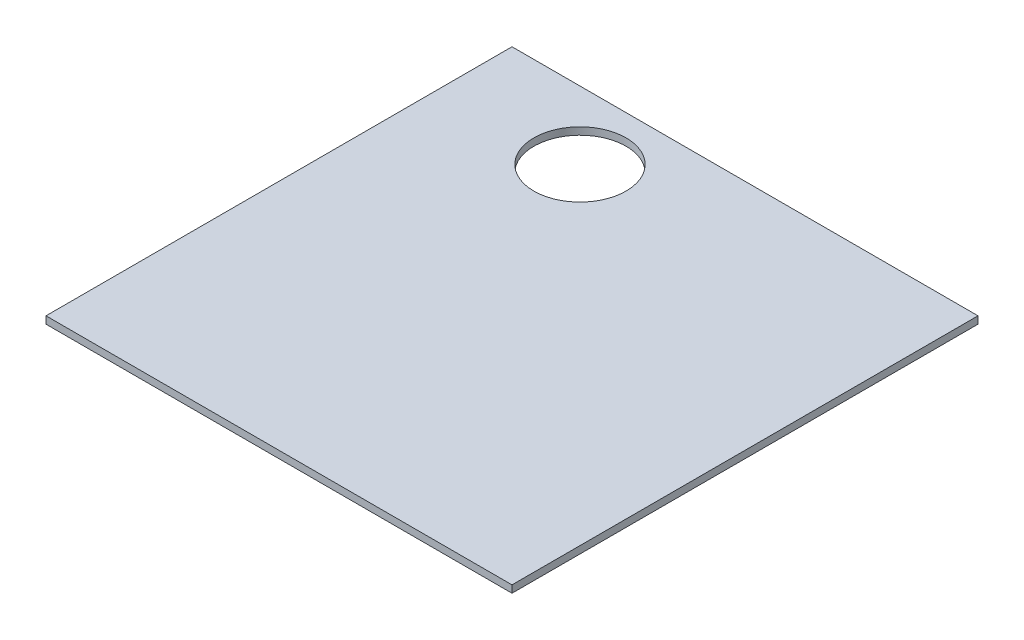
ISO-10303-21;
HEADER;
FILE_DESCRIPTION(('STEP AP214'),'2;1');
FILE_NAME('part.step','',(''),(''),'','','');
FILE_SCHEMA(('AUTOMOTIVE_DESIGN { 1 0 10303 214 1 1 1 1 }'));
ENDSEC;
DATA;
#1=APPLICATION_CONTEXT('core data for automotive mechanical design processes');
#2=APPLICATION_PROTOCOL_DEFINITION('international standard','automotive_design',2000,#1);
#3=PRODUCT_CONTEXT('',#1,'mechanical');
#4=PRODUCT('Part','Part','',(#3));
#5=PRODUCT_RELATED_PRODUCT_CATEGORY('part','',(#4));
#6=PRODUCT_DEFINITION_FORMATION('','',#4);
#7=PRODUCT_DEFINITION_CONTEXT('part definition',#1,'design');
#8=PRODUCT_DEFINITION('design','',#6,#7);
#9=PRODUCT_DEFINITION_SHAPE('','',#8);
#10=(LENGTH_UNIT() NAMED_UNIT(*) SI_UNIT(.MILLI.,.METRE.));
#11=(NAMED_UNIT(*) PLANE_ANGLE_UNIT() SI_UNIT($,.RADIAN.));
#12=(NAMED_UNIT(*) SI_UNIT($,.STERADIAN.) SOLID_ANGLE_UNIT());
#13=UNCERTAINTY_MEASURE_WITH_UNIT(LENGTH_MEASURE(1.E-05),#10,'distance_accuracy_value','');
#14=(GEOMETRIC_REPRESENTATION_CONTEXT(3) GLOBAL_UNCERTAINTY_ASSIGNED_CONTEXT((#13)) GLOBAL_UNIT_ASSIGNED_CONTEXT((#10,
#11,#12)) REPRESENTATION_CONTEXT('',''));
#15=CARTESIAN_POINT('',(0.,0.,0.));
#16=DIRECTION('',(0.,0.,1.));
#17=DIRECTION('',(1.,0.,0.));
#18=AXIS2_PLACEMENT_3D('',#15,#16,#17);
#19=CARTESIAN_POINT('',(0.,4.7625,0.));
#20=DIRECTION('',(1.,0.,0.));
#21=DIRECTION('',(0.,0.,-1.));
#22=AXIS2_PLACEMENT_3D('',#19,#20,#21);
#23=PLANE('',#22);
#24=DIRECTION('',(0.,0.,1.));
#25=VECTOR('',#24,1.);
#26=CARTESIAN_POINT('',(0.,0.,0.));
#27=LINE('',#26,#25);
#28=CARTESIAN_POINT('',(0.,0.,-304.8));
#29=VERTEX_POINT('',#28);
#30=CARTESIAN_POINT('',(0.,0.,0.));
#31=VERTEX_POINT('',#30);
#32=EDGE_CURVE('E107',#29,#31,#27,.T.);
#33=ORIENTED_EDGE('',*,*,#32,.T.);
#34=DIRECTION('',(0.,-1.,0.));
#35=VECTOR('',#34,1.);
#36=CARTESIAN_POINT('',(0.,4.7625,0.));
#37=LINE('',#36,#35);
#38=CARTESIAN_POINT('',(0.,4.7625,0.));
#39=VERTEX_POINT('',#38);
#40=EDGE_CURVE('E11',#39,#31,#37,.T.);
#41=ORIENTED_EDGE('',*,*,#40,.F.);
#42=DIRECTION('',(0.,0.,1.));
#43=VECTOR('',#42,1.);
#44=CARTESIAN_POINT('',(0.,4.7625,0.));
#45=LINE('',#44,#43);
#46=CARTESIAN_POINT('',(0.,4.7625,-304.8));
#47=VERTEX_POINT('',#46);
#48=EDGE_CURVE('E91',#47,#39,#45,.T.);
#49=ORIENTED_EDGE('',*,*,#48,.F.);
#50=DIRECTION('',(0.,-1.,0.));
#51=VECTOR('',#50,1.);
#52=CARTESIAN_POINT('',(0.,4.7625,-304.8));
#53=LINE('',#52,#51);
#54=EDGE_CURVE('E103',#47,#29,#53,.T.);
#55=ORIENTED_EDGE('',*,*,#54,.T.);
#56=EDGE_LOOP('',(#33,#41,#49,#55));
#57=FACE_BOUND('',#56,.T.);
#58=ADVANCED_FACE('F39',(#57),#23,.F.);
#59=CARTESIAN_POINT('',(0.,4.7625,0.));
#60=DIRECTION('',(0.,0.,-1.));
#61=DIRECTION('',(-1.,0.,0.));
#62=AXIS2_PLACEMENT_3D('',#59,#60,#61);
#63=PLANE('',#62);
#64=DIRECTION('',(1.,0.,0.));
#65=VECTOR('',#64,1.);
#66=CARTESIAN_POINT('',(0.,0.,0.));
#67=LINE('',#66,#65);
#68=CARTESIAN_POINT('',(304.8,0.,0.));
#69=VERTEX_POINT('',#68);
#70=EDGE_CURVE('E96',#31,#69,#67,.T.);
#71=ORIENTED_EDGE('',*,*,#70,.T.);
#72=DIRECTION('',(0.,-1.,0.));
#73=VECTOR('',#72,1.);
#74=CARTESIAN_POINT('',(304.8,4.7625,0.));
#75=LINE('',#74,#73);
#76=CARTESIAN_POINT('',(304.8,4.7625,0.));
#77=VERTEX_POINT('',#76);
#78=EDGE_CURVE('E48',#77,#69,#75,.T.);
#79=ORIENTED_EDGE('',*,*,#78,.F.);
#80=DIRECTION('',(1.,0.,0.));
#81=VECTOR('',#80,1.);
#82=CARTESIAN_POINT('',(0.,4.7625,0.));
#83=LINE('',#82,#81);
#84=EDGE_CURVE('E86',#39,#77,#83,.T.);
#85=ORIENTED_EDGE('',*,*,#84,.F.);
#86=ORIENTED_EDGE('',*,*,#40,.T.);
#87=EDGE_LOOP('',(#71,#79,#85,#86));
#88=FACE_BOUND('',#87,.T.);
#89=ADVANCED_FACE('F95',(#88),#63,.F.);
#90=CARTESIAN_POINT('',(304.8,4.7625,0.));
#91=DIRECTION('',(-1.,0.,0.));
#92=DIRECTION('',(0.,0.,1.));
#93=AXIS2_PLACEMENT_3D('',#90,#91,#92);
#94=PLANE('',#93);
#95=DIRECTION('',(0.,0.,-1.));
#96=VECTOR('',#95,1.);
#97=CARTESIAN_POINT('',(304.8,0.,0.));
#98=LINE('',#97,#96);
#99=CARTESIAN_POINT('',(304.8,0.,-304.8));
#100=VERTEX_POINT('',#99);
#101=EDGE_CURVE('E73',#69,#100,#98,.T.);
#102=ORIENTED_EDGE('',*,*,#101,.T.);
#103=DIRECTION('',(0.,-1.,0.));
#104=VECTOR('',#103,1.);
#105=CARTESIAN_POINT('',(304.8,4.7625,-304.8));
#106=LINE('',#105,#104);
#107=CARTESIAN_POINT('',(304.8,4.7625,-304.8));
#108=VERTEX_POINT('',#107);
#109=EDGE_CURVE('E98',#108,#100,#106,.T.);
#110=ORIENTED_EDGE('',*,*,#109,.F.);
#111=DIRECTION('',(0.,0.,-1.));
#112=VECTOR('',#111,1.);
#113=CARTESIAN_POINT('',(304.8,4.7625,0.));
#114=LINE('',#113,#112);
#115=EDGE_CURVE('E89',#77,#108,#114,.T.);
#116=ORIENTED_EDGE('',*,*,#115,.F.);
#117=ORIENTED_EDGE('',*,*,#78,.T.);
#118=EDGE_LOOP('',(#102,#110,#116,#117));
#119=FACE_BOUND('',#118,.T.);
#120=ADVANCED_FACE('F99',(#119),#94,.F.);
#121=CARTESIAN_POINT('',(0.,4.7625,-304.8));
#122=DIRECTION('',(0.,0.,1.));
#123=DIRECTION('',(1.,0.,0.));
#124=AXIS2_PLACEMENT_3D('',#121,#122,#123);
#125=PLANE('',#124);
#126=DIRECTION('',(-1.,0.,0.));
#127=VECTOR('',#126,1.);
#128=CARTESIAN_POINT('',(0.,0.,-304.8));
#129=LINE('',#128,#127);
#130=EDGE_CURVE('E79',#100,#29,#129,.T.);
#131=ORIENTED_EDGE('',*,*,#130,.T.);
#132=ORIENTED_EDGE('',*,*,#54,.F.);
#133=DIRECTION('',(-1.,0.,0.));
#134=VECTOR('',#133,1.);
#135=CARTESIAN_POINT('',(0.,4.7625,-304.8));
#136=LINE('',#135,#134);
#137=EDGE_CURVE('E56',#108,#47,#136,.T.);
#138=ORIENTED_EDGE('',*,*,#137,.F.);
#139=ORIENTED_EDGE('',*,*,#109,.T.);
#140=EDGE_LOOP('',(#131,#132,#138,#139));
#141=FACE_BOUND('',#140,.T.);
#142=ADVANCED_FACE('F121',(#141),#125,.F.);
#143=CARTESIAN_POINT('',(0.,4.7625,0.));
#144=DIRECTION('',(0.,-1.,0.));
#145=DIRECTION('',(0.,0.,-1.));
#146=AXIS2_PLACEMENT_3D('',#143,#144,#145);
#147=PLANE('',#146);
#148=CARTESIAN_POINT('',(88.9,4.7625,-260.35));
#149=DIRECTION('',(0.,1.,0.));
#150=DIRECTION('',(0.,0.,1.));
#151=AXIS2_PLACEMENT_3D('',#148,#149,#150);
#152=CIRCLE('',#151,30.1625);
#153=CARTESIAN_POINT('',(88.9,4.7625,-230.1875));
#154=VERTEX_POINT('',#153);
#155=EDGE_CURVE('E128',#154,#154,#152,.T.);
#156=ORIENTED_EDGE('',*,*,#155,.F.);
#157=EDGE_LOOP('',(#156));
#158=FACE_BOUND('',#157,.T.);
#159=ORIENTED_EDGE('',*,*,#48,.T.);
#160=ORIENTED_EDGE('',*,*,#84,.T.);
#161=ORIENTED_EDGE('',*,*,#115,.T.);
#162=ORIENTED_EDGE('',*,*,#137,.T.);
#163=EDGE_LOOP('',(#159,#160,#161,#162));
#164=FACE_BOUND('',#163,.T.);
#165=ADVANCED_FACE('F87',(#158,#164),#147,.F.);
#166=CARTESIAN_POINT('',(0.,0.,0.));
#167=DIRECTION('',(0.,-1.,0.));
#168=DIRECTION('',(0.,0.,-1.));
#169=AXIS2_PLACEMENT_3D('',#166,#167,#168);
#170=PLANE('',#169);
#171=CARTESIAN_POINT('',(88.9,0.,-260.35));
#172=DIRECTION('',(0.,1.,0.));
#173=DIRECTION('',(0.,0.,1.));
#174=AXIS2_PLACEMENT_3D('',#171,#172,#173);
#175=CIRCLE('',#174,30.1625);
#176=CARTESIAN_POINT('',(88.9,0.,-230.1875));
#177=VERTEX_POINT('',#176);
#178=EDGE_CURVE('E111',#177,#177,#175,.T.);
#179=ORIENTED_EDGE('',*,*,#178,.T.);
#180=EDGE_LOOP('',(#179));
#181=FACE_BOUND('',#180,.T.);
#182=ORIENTED_EDGE('',*,*,#32,.F.);
#183=ORIENTED_EDGE('',*,*,#130,.F.);
#184=ORIENTED_EDGE('',*,*,#101,.F.);
#185=ORIENTED_EDGE('',*,*,#70,.F.);
#186=EDGE_LOOP('',(#182,#183,#184,#185));
#187=FACE_BOUND('',#186,.T.);
#188=ADVANCED_FACE('F124',(#181,#187),#170,.T.);
#189=CARTESIAN_POINT('',(88.9,0.,-260.35));
#190=DIRECTION('',(0.,1.,0.));
#191=DIRECTION('',(0.,0.,1.));
#192=AXIS2_PLACEMENT_3D('',#189,#190,#191);
#193=CYLINDRICAL_SURFACE('',#192,30.1625);
#194=ORIENTED_EDGE('',*,*,#178,.F.);
#195=EDGE_LOOP('',(#194));
#196=FACE_BOUND('',#195,.T.);
#197=ORIENTED_EDGE('',*,*,#155,.T.);
#198=EDGE_LOOP('',(#197));
#199=FACE_BOUND('',#198,.T.);
#200=ADVANCED_FACE('F137',(#196,#199),#193,.F.);
#201=CLOSED_SHELL('',(#58,#89,#120,#142,#165,#188,#200));
#202=MANIFOLD_SOLID_BREP('B2',#201);
#203=ADVANCED_BREP_SHAPE_REPRESENTATION('',(#18,#202),#14);
#204=SHAPE_DEFINITION_REPRESENTATION(#9,#203);
ENDSEC;
END-ISO-10303-21;
